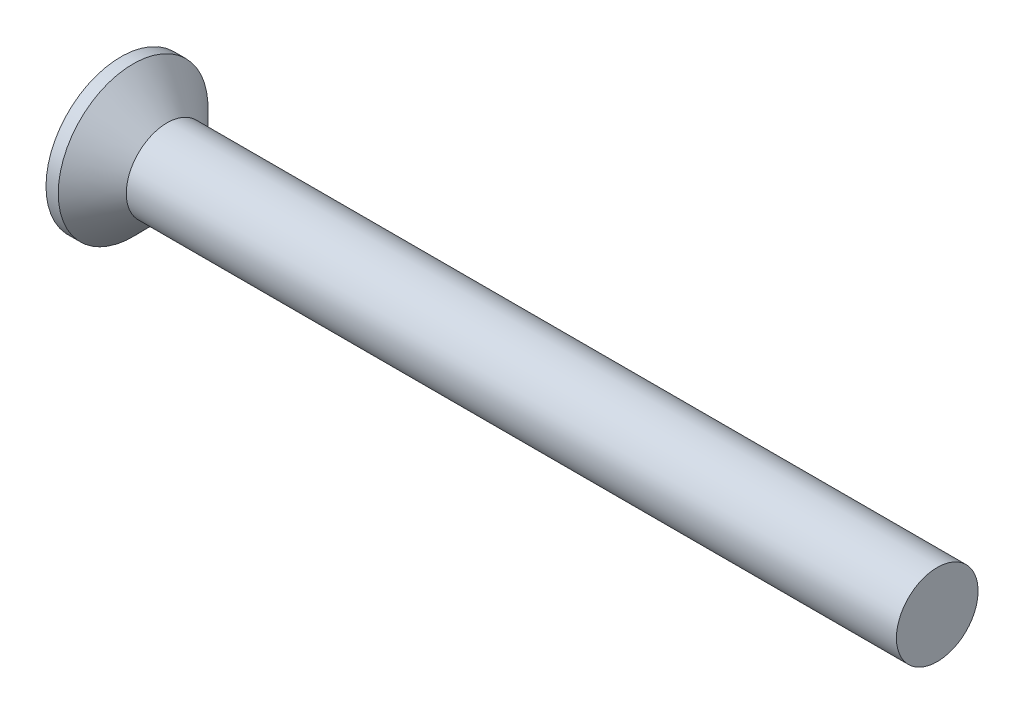
ISO-10303-21;
HEADER;
FILE_DESCRIPTION(('STEP AP214'),'2;1');
FILE_NAME('part.step','',(''),(''),'','','');
FILE_SCHEMA(('AUTOMOTIVE_DESIGN { 1 0 10303 214 1 1 1 1 }'));
ENDSEC;
DATA;
#1=APPLICATION_CONTEXT('core data for automotive mechanical design processes');
#2=APPLICATION_PROTOCOL_DEFINITION('international standard','automotive_design',2000,#1);
#3=PRODUCT_CONTEXT('',#1,'mechanical');
#4=PRODUCT('Part','Part','',(#3));
#5=PRODUCT_RELATED_PRODUCT_CATEGORY('part','',(#4));
#6=PRODUCT_DEFINITION_FORMATION('','',#4);
#7=PRODUCT_DEFINITION_CONTEXT('part definition',#1,'design');
#8=PRODUCT_DEFINITION('design','',#6,#7);
#9=PRODUCT_DEFINITION_SHAPE('','',#8);
#10=(LENGTH_UNIT() NAMED_UNIT(*) SI_UNIT(.MILLI.,.METRE.));
#11=(NAMED_UNIT(*) PLANE_ANGLE_UNIT() SI_UNIT($,.RADIAN.));
#12=(NAMED_UNIT(*) SI_UNIT($,.STERADIAN.) SOLID_ANGLE_UNIT());
#13=UNCERTAINTY_MEASURE_WITH_UNIT(LENGTH_MEASURE(1.E-05),#10,'distance_accuracy_value','');
#14=(GEOMETRIC_REPRESENTATION_CONTEXT(3) GLOBAL_UNCERTAINTY_ASSIGNED_CONTEXT((#13)) GLOBAL_UNIT_ASSIGNED_CONTEXT((#10,
#11,#12)) REPRESENTATION_CONTEXT('',''));
#15=CARTESIAN_POINT('',(0.,0.,0.));
#16=DIRECTION('',(0.,0.,1.));
#17=DIRECTION('',(1.,0.,0.));
#18=AXIS2_PLACEMENT_3D('',#15,#16,#17);
#19=CARTESIAN_POINT('',(0.,0.,0.));
#20=DIRECTION('',(-1.,0.,0.));
#21=DIRECTION('',(0.,0.,1.));
#22=AXIS2_PLACEMENT_3D('',#19,#20,#21);
#23=PLANE('',#22);
#24=CARTESIAN_POINT('',(0.,0.,0.));
#25=DIRECTION('',(-1.,0.,0.));
#26=DIRECTION('',(0.,0.,1.));
#27=AXIS2_PLACEMENT_3D('',#24,#25,#26);
#28=CIRCLE('',#27,2.75);
#29=CARTESIAN_POINT('',(0.,0.,2.75));
#30=VERTEX_POINT('',#29);
#31=EDGE_CURVE('E44',#30,#30,#28,.T.);
#32=ORIENTED_EDGE('',*,*,#31,.T.);
#33=EDGE_LOOP('',(#32));
#34=FACE_BOUND('',#33,.T.);
#35=DIRECTION('',(0.,1.,0.));
#36=VECTOR('',#35,1.);
#37=CARTESIAN_POINT('',(0.,-1.55,-0.395));
#38=LINE('',#37,#36);
#39=CARTESIAN_POINT('',(0.,-1.55,-0.395));
#40=VERTEX_POINT('',#39);
#41=CARTESIAN_POINT('',(0.,-0.394999999999998,-0.395));
#42=VERTEX_POINT('',#41);
#43=EDGE_CURVE('E105',#40,#42,#38,.T.);
#44=ORIENTED_EDGE('',*,*,#43,.T.);
#45=DIRECTION('',(0.,0.,-1.));
#46=VECTOR('',#45,1.);
#47=CARTESIAN_POINT('',(0.,-0.395000000000005,1.55));
#48=LINE('',#47,#46);
#49=CARTESIAN_POINT('',(0.,-0.394999999999995,-1.55));
#50=VERTEX_POINT('',#49);
#51=EDGE_CURVE('E85',#42,#50,#48,.T.);
#52=ORIENTED_EDGE('',*,*,#51,.T.);
#53=DIRECTION('',(0.,1.,0.));
#54=VECTOR('',#53,1.);
#55=CARTESIAN_POINT('',(0.,-0.394999999999995,-1.55));
#56=LINE('',#55,#54);
#57=CARTESIAN_POINT('',(0.,0.395000000000005,-1.55));
#58=VERTEX_POINT('',#57);
#59=EDGE_CURVE('E344',#50,#58,#56,.T.);
#60=ORIENTED_EDGE('',*,*,#59,.T.);
#61=DIRECTION('',(0.,0.,1.));
#62=VECTOR('',#61,1.);
#63=CARTESIAN_POINT('',(0.,0.395000000000005,-1.55));
#64=LINE('',#63,#62);
#65=CARTESIAN_POINT('',(0.,0.395000000000001,-0.395));
#66=VERTEX_POINT('',#65);
#67=EDGE_CURVE('E101',#58,#66,#64,.T.);
#68=ORIENTED_EDGE('',*,*,#67,.T.);
#69=CARTESIAN_POINT('',(0.,1.55,-0.395));
#70=VERTEX_POINT('',#69);
#71=EDGE_CURVE('E95',#66,#70,#38,.T.);
#72=ORIENTED_EDGE('',*,*,#71,.T.);
#73=DIRECTION('',(0.,0.,1.));
#74=VECTOR('',#73,1.);
#75=CARTESIAN_POINT('',(0.,1.55,-0.395));
#76=LINE('',#75,#74);
#77=CARTESIAN_POINT('',(0.,1.55,0.395));
#78=VERTEX_POINT('',#77);
#79=EDGE_CURVE('E98',#70,#78,#76,.T.);
#80=ORIENTED_EDGE('',*,*,#79,.T.);
#81=DIRECTION('',(0.,-1.,0.));
#82=VECTOR('',#81,1.);
#83=CARTESIAN_POINT('',(0.,1.55,0.395));
#84=LINE('',#83,#82);
#85=CARTESIAN_POINT('',(0.,0.394999999999998,0.395));
#86=VERTEX_POINT('',#85);
#87=EDGE_CURVE('E356',#78,#86,#84,.T.);
#88=ORIENTED_EDGE('',*,*,#87,.T.);
#89=CARTESIAN_POINT('',(0.,0.394999999999994,1.55));
#90=VERTEX_POINT('',#89);
#91=EDGE_CURVE('E339',#86,#90,#64,.T.);
#92=ORIENTED_EDGE('',*,*,#91,.T.);
#93=DIRECTION('',(0.,-1.,0.));
#94=VECTOR('',#93,1.);
#95=CARTESIAN_POINT('',(0.,0.394999999999994,1.55));
#96=LINE('',#95,#94);
#97=CARTESIAN_POINT('',(0.,-0.395000000000005,1.55));
#98=VERTEX_POINT('',#97);
#99=EDGE_CURVE('E325',#90,#98,#96,.T.);
#100=ORIENTED_EDGE('',*,*,#99,.T.);
#101=CARTESIAN_POINT('',(0.,-0.395000000000001,0.395));
#102=VERTEX_POINT('',#101);
#103=EDGE_CURVE('E337',#98,#102,#48,.T.);
#104=ORIENTED_EDGE('',*,*,#103,.T.);
#105=CARTESIAN_POINT('',(0.,-1.55,0.395));
#106=VERTEX_POINT('',#105);
#107=EDGE_CURVE('E111',#102,#106,#84,.T.);
#108=ORIENTED_EDGE('',*,*,#107,.T.);
#109=DIRECTION('',(0.,0.,-1.));
#110=VECTOR('',#109,1.);
#111=CARTESIAN_POINT('',(0.,-1.55,0.395));
#112=LINE('',#111,#110);
#113=EDGE_CURVE('E134',#106,#40,#112,.T.);
#114=ORIENTED_EDGE('',*,*,#113,.T.);
#115=EDGE_LOOP('',(#44,#52,#60,#68,#72,#80,#88,#92,#100,#104,#108,#114));
#116=FACE_BOUND('',#115,.T.);
#117=ADVANCED_FACE('F37',(#34,#116),#23,.T.);
#118=CARTESIAN_POINT('',(2.38373382624769,0.,0.16865988909427));
#119=DIRECTION('',(-0.0945267588569114,0.,-0.995522321125954));
#120=DIRECTION('',(-0.995522321125954,0.,0.0945267588569114));
#121=AXIS2_PLACEMENT_3D('',#118,#119,#120);
#122=PLANE('',#121);
#123=ORIENTED_EDGE('',*,*,#107,.F.);
#124=DIRECTION('',(0.991104257398676,0.0941072552097303,-0.09410725520973));
#125=VECTOR('',#124,1.);
#126=CARTESIAN_POINT('',(2.39946475118715,-0.16716620751949,0.167166207519489));
#127=LINE('',#126,#125);
#128=CARTESIAN_POINT('',(2.08,-0.197500000000001,0.197499999999999));
#129=VERTEX_POINT('',#128);
#130=EDGE_CURVE('E129',#102,#129,#127,.T.);
#131=ORIENTED_EDGE('',*,*,#130,.T.);
#132=DIRECTION('',(0.835707904588477,0.543411029305729,-0.0793520726712616));
#133=VECTOR('',#132,1.);
#134=CARTESIAN_POINT('',(0.,-1.55,0.395));
#135=LINE('',#134,#133);
#136=EDGE_CURVE('E106',#106,#129,#135,.T.);
#137=ORIENTED_EDGE('',*,*,#136,.F.);
#138=EDGE_LOOP('',(#123,#131,#137));
#139=FACE_BOUND('',#138,.T.);
#140=ADVANCED_FACE('F157',(#139),#122,.T.);
#141=DIRECTION('',(0.835707904588477,-0.543411029305729,-0.0793520726712616));
#142=VECTOR('',#141,1.);
#143=CARTESIAN_POINT('',(0.,1.55,0.395));
#144=LINE('',#143,#142);
#145=CARTESIAN_POINT('',(2.08,0.1975,0.1975));
#146=VERTEX_POINT('',#145);
#147=EDGE_CURVE('E51',#78,#146,#144,.T.);
#148=ORIENTED_EDGE('',*,*,#147,.T.);
#149=DIRECTION('',(-0.991104257398676,0.0941072552097295,0.09410725520973));
#150=VECTOR('',#149,1.);
#151=CARTESIAN_POINT('',(2.39946475118715,0.167166207519489,0.167166207519489));
#152=LINE('',#151,#150);
#153=EDGE_CURVE('E352',#146,#86,#152,.T.);
#154=ORIENTED_EDGE('',*,*,#153,.T.);
#155=ORIENTED_EDGE('',*,*,#87,.F.);
#156=EDGE_LOOP('',(#148,#154,#155));
#157=FACE_BOUND('',#156,.T.);
#158=ADVANCED_FACE('F161',(#157),#122,.T.);
#159=CARTESIAN_POINT('',(2.38373382624769,0.,-0.16865988909427));
#160=DIRECTION('',(-0.0945267588569113,0.,0.995522321125954));
#161=DIRECTION('',(0.995522321125954,0.,0.0945267588569113));
#162=AXIS2_PLACEMENT_3D('',#159,#160,#161);
#163=PLANE('',#162);
#164=DIRECTION('',(0.835707904588477,0.543411029305729,0.0793520726712615));
#165=VECTOR('',#164,1.);
#166=CARTESIAN_POINT('',(0.,-1.55,-0.395));
#167=LINE('',#166,#165);
#168=CARTESIAN_POINT('',(2.08,-0.197499999999999,-0.197500000000001));
#169=VERTEX_POINT('',#168);
#170=EDGE_CURVE('E60',#40,#169,#167,.T.);
#171=ORIENTED_EDGE('',*,*,#170,.T.);
#172=DIRECTION('',(-0.991104257398676,-0.0941072552097297,-0.0941072552097299));
#173=VECTOR('',#172,1.);
#174=CARTESIAN_POINT('',(2.39946475118715,-0.167166207519489,-0.167166207519489));
#175=LINE('',#174,#173);
#176=EDGE_CURVE('E11',#169,#42,#175,.T.);
#177=ORIENTED_EDGE('',*,*,#176,.T.);
#178=ORIENTED_EDGE('',*,*,#43,.F.);
#179=EDGE_LOOP('',(#171,#177,#178));
#180=FACE_BOUND('',#179,.T.);
#181=ADVANCED_FACE('F154',(#180),#163,.T.);
#182=ORIENTED_EDGE('',*,*,#71,.F.);
#183=DIRECTION('',(0.991104257398676,-0.0941072552097302,0.0941072552097299));
#184=VECTOR('',#183,1.);
#185=CARTESIAN_POINT('',(2.39946475118715,0.16716620751949,-0.167166207519489));
#186=LINE('',#185,#184);
#187=CARTESIAN_POINT('',(2.08,0.1975,-0.1975));
#188=VERTEX_POINT('',#187);
#189=EDGE_CURVE('E114',#66,#188,#186,.T.);
#190=ORIENTED_EDGE('',*,*,#189,.T.);
#191=DIRECTION('',(0.835707904588477,-0.543411029305729,0.0793520726712615));
#192=VECTOR('',#191,1.);
#193=CARTESIAN_POINT('',(0.,1.55,-0.395));
#194=LINE('',#193,#192);
#195=EDGE_CURVE('E110',#70,#188,#194,.T.);
#196=ORIENTED_EDGE('',*,*,#195,.F.);
#197=EDGE_LOOP('',(#182,#190,#196));
#198=FACE_BOUND('',#197,.T.);
#199=ADVANCED_FACE('F113',(#198),#163,.T.);
#200=CARTESIAN_POINT('',(-6.34999999999999,0.,0.));
#201=DIRECTION('',(-1.,0.,0.));
#202=DIRECTION('',(0.,0.,1.));
#203=AXIS2_PLACEMENT_3D('',#200,#201,#202);
#204=CYLINDRICAL_SURFACE('',#203,2.75);
#205=CARTESIAN_POINT('',(0.450000000000006,0.,0.));
#206=DIRECTION('',(-1.,0.,0.));
#207=DIRECTION('',(0.,0.,1.));
#208=AXIS2_PLACEMENT_3D('',#205,#206,#207);
#209=CIRCLE('',#208,2.75);
#210=CARTESIAN_POINT('',(0.450000000000006,0.,2.75));
#211=VERTEX_POINT('',#210);
#212=EDGE_CURVE('E137',#211,#211,#209,.T.);
#213=ORIENTED_EDGE('',*,*,#212,.T.);
#214=EDGE_LOOP('',(#213));
#215=FACE_BOUND('',#214,.T.);
#216=ORIENTED_EDGE('',*,*,#31,.F.);
#217=EDGE_LOOP('',(#216));
#218=FACE_BOUND('',#217,.T.);
#219=ADVANCED_FACE('F143',(#215,#218),#204,.T.);
#220=CARTESIAN_POINT('',(0.450000000000006,0.,0.));
#221=DIRECTION('',(-1.,0.,0.));
#222=DIRECTION('',(0.,0.,1.));
#223=AXIS2_PLACEMENT_3D('',#220,#221,#222);
#224=CONICAL_SURFACE('',#223,2.75,0.78539816339745);
#225=CARTESIAN_POINT('',(1.7,0.,0.));
#226=DIRECTION('',(-1.,0.,0.));
#227=DIRECTION('',(0.,0.,1.));
#228=AXIS2_PLACEMENT_3D('',#225,#226,#227);
#229=CIRCLE('',#228,1.5);
#230=CARTESIAN_POINT('',(1.7,0.,1.5));
#231=VERTEX_POINT('',#230);
#232=EDGE_CURVE('E133',#231,#231,#229,.T.);
#233=ORIENTED_EDGE('',*,*,#232,.T.);
#234=EDGE_LOOP('',(#233));
#235=FACE_BOUND('',#234,.T.);
#236=ORIENTED_EDGE('',*,*,#212,.F.);
#237=EDGE_LOOP('',(#236));
#238=FACE_BOUND('',#237,.T.);
#239=ADVANCED_FACE('F145',(#235,#238),#224,.T.);
#240=CARTESIAN_POINT('',(-6.34999999999999,0.,0.));
#241=DIRECTION('',(-1.,0.,0.));
#242=DIRECTION('',(0.,0.,1.));
#243=AXIS2_PLACEMENT_3D('',#240,#241,#242);
#244=CYLINDRICAL_SURFACE('',#243,1.5);
#245=CARTESIAN_POINT('',(30.,0.,0.));
#246=DIRECTION('',(-1.,0.,0.));
#247=DIRECTION('',(0.,0.,1.));
#248=AXIS2_PLACEMENT_3D('',#245,#246,#247);
#249=CIRCLE('',#248,1.5);
#250=CARTESIAN_POINT('',(30.,0.,1.5));
#251=VERTEX_POINT('',#250);
#252=EDGE_CURVE('E130',#251,#251,#249,.T.);
#253=ORIENTED_EDGE('',*,*,#252,.T.);
#254=EDGE_LOOP('',(#253));
#255=FACE_BOUND('',#254,.T.);
#256=ORIENTED_EDGE('',*,*,#232,.F.);
#257=EDGE_LOOP('',(#256));
#258=FACE_BOUND('',#257,.T.);
#259=ADVANCED_FACE('F151',(#255,#258),#244,.T.);
#260=CARTESIAN_POINT('',(30.,1.5,0.));
#261=DIRECTION('',(1.,0.,0.));
#262=DIRECTION('',(0.,0.,-1.));
#263=AXIS2_PLACEMENT_3D('',#260,#261,#262);
#264=PLANE('',#263);
#265=ORIENTED_EDGE('',*,*,#252,.F.);
#266=EDGE_LOOP('',(#265));
#267=FACE_BOUND('',#266,.T.);
#268=ADVANCED_FACE('F181',(#267),#264,.T.);
#269=CARTESIAN_POINT('',(2.08,0.1975,-0.1975));
#270=DIRECTION('',(1.,0.,0.));
#271=DIRECTION('',(0.,0.,-1.));
#272=AXIS2_PLACEMENT_3D('',#269,#270,#271);
#273=PLANE('',#272);
#274=DIRECTION('',(0.,1.,0.));
#275=VECTOR('',#274,1.);
#276=CARTESIAN_POINT('',(2.08,-0.1975,-0.1975));
#277=LINE('',#276,#275);
#278=EDGE_CURVE('E125',#169,#188,#277,.T.);
#279=ORIENTED_EDGE('',*,*,#278,.F.);
#280=DIRECTION('',(0.,0.,-1.));
#281=VECTOR('',#280,1.);
#282=CARTESIAN_POINT('',(2.08,-0.1975,0.1975));
#283=LINE('',#282,#281);
#284=EDGE_CURVE('E116',#129,#169,#283,.T.);
#285=ORIENTED_EDGE('',*,*,#284,.F.);
#286=DIRECTION('',(0.,-1.,0.));
#287=VECTOR('',#286,1.);
#288=CARTESIAN_POINT('',(2.08,0.1975,0.1975));
#289=LINE('',#288,#287);
#290=EDGE_CURVE('E119',#146,#129,#289,.T.);
#291=ORIENTED_EDGE('',*,*,#290,.F.);
#292=DIRECTION('',(0.,0.,1.));
#293=VECTOR('',#292,1.);
#294=CARTESIAN_POINT('',(2.08,0.1975,-0.1975));
#295=LINE('',#294,#293);
#296=EDGE_CURVE('E123',#188,#146,#295,.T.);
#297=ORIENTED_EDGE('',*,*,#296,.F.);
#298=EDGE_LOOP('',(#279,#285,#291,#297));
#299=FACE_BOUND('',#298,.T.);
#300=ADVANCED_FACE('F178',(#299),#273,.F.);
#301=CARTESIAN_POINT('',(2.08,-0.1975,-0.1975));
#302=DIRECTION('',(-0.54513001368185,0.838351518268576,0.));
#303=DIRECTION('',(-0.838351518268576,-0.54513001368185,0.));
#304=AXIS2_PLACEMENT_3D('',#301,#302,#303);
#305=PLANE('',#304);
#306=ORIENTED_EDGE('',*,*,#170,.F.);
#307=ORIENTED_EDGE('',*,*,#113,.F.);
#308=ORIENTED_EDGE('',*,*,#136,.T.);
#309=ORIENTED_EDGE('',*,*,#284,.T.);
#310=EDGE_LOOP('',(#306,#307,#308,#309));
#311=FACE_BOUND('',#310,.T.);
#312=ADVANCED_FACE('F170',(#311),#305,.T.);
#313=CARTESIAN_POINT('',(0.,1.55,0.395));
#314=DIRECTION('',(-0.54513001368185,-0.838351518268575,0.));
#315=DIRECTION('',(0.838351518268576,-0.54513001368185,0.));
#316=AXIS2_PLACEMENT_3D('',#313,#314,#315);
#317=PLANE('',#316);
#318=ORIENTED_EDGE('',*,*,#147,.F.);
#319=ORIENTED_EDGE('',*,*,#79,.F.);
#320=ORIENTED_EDGE('',*,*,#195,.T.);
#321=ORIENTED_EDGE('',*,*,#296,.T.);
#322=EDGE_LOOP('',(#318,#319,#320,#321));
#323=FACE_BOUND('',#322,.T.);
#324=ADVANCED_FACE('F109',(#323),#317,.T.);
#325=CARTESIAN_POINT('',(2.38373382624769,-0.16865988909427,0.));
#326=DIRECTION('',(-0.0945267588569114,0.995522321125954,0.));
#327=DIRECTION('',(-0.995522321125954,-0.0945267588569114,0.));
#328=AXIS2_PLACEMENT_3D('',#325,#326,#327);
#329=PLANE('',#328);
#330=DIRECTION('',(0.835707904588477,0.0793520726712597,0.543411029305729));
#331=VECTOR('',#330,1.);
#332=CARTESIAN_POINT('',(0.,-0.394999999999995,-1.55));
#333=LINE('',#332,#331);
#334=EDGE_CURVE('E346',#50,#169,#333,.T.);
#335=ORIENTED_EDGE('',*,*,#334,.F.);
#336=ORIENTED_EDGE('',*,*,#51,.F.);
#337=ORIENTED_EDGE('',*,*,#176,.F.);
#338=EDGE_LOOP('',(#335,#336,#337));
#339=FACE_BOUND('',#338,.T.);
#340=ADVANCED_FACE('F177',(#339),#329,.T.);
#341=CARTESIAN_POINT('',(2.38373382624769,0.16865988909427,0.));
#342=DIRECTION('',(-0.0945267588569113,-0.995522321125954,0.));
#343=DIRECTION('',(0.995522321125954,-0.0945267588569113,0.));
#344=AXIS2_PLACEMENT_3D('',#341,#342,#343);
#345=PLANE('',#344);
#346=ORIENTED_EDGE('',*,*,#67,.F.);
#347=DIRECTION('',(0.835707904588477,-0.0793520726712634,0.543411029305728));
#348=VECTOR('',#347,1.);
#349=CARTESIAN_POINT('',(0.,0.395000000000005,-1.55));
#350=LINE('',#349,#348);
#351=EDGE_CURVE('E76',#58,#188,#350,.T.);
#352=ORIENTED_EDGE('',*,*,#351,.T.);
#353=ORIENTED_EDGE('',*,*,#189,.F.);
#354=EDGE_LOOP('',(#346,#352,#353));
#355=FACE_BOUND('',#354,.T.);
#356=ADVANCED_FACE('F222',(#355),#345,.T.);
#357=CARTESIAN_POINT('',(2.08,0.1975,-0.197499999999999));
#358=DIRECTION('',(-0.54513001368185,0.,0.838351518268576));
#359=DIRECTION('',(-0.838351518268576,0.,-0.54513001368185));
#360=AXIS2_PLACEMENT_3D('',#357,#358,#359);
#361=PLANE('',#360);
#362=ORIENTED_EDGE('',*,*,#351,.F.);
#363=ORIENTED_EDGE('',*,*,#59,.F.);
#364=ORIENTED_EDGE('',*,*,#334,.T.);
#365=ORIENTED_EDGE('',*,*,#278,.T.);
#366=EDGE_LOOP('',(#362,#363,#364,#365));
#367=FACE_BOUND('',#366,.T.);
#368=ADVANCED_FACE('F230',(#367),#361,.T.);
#369=ORIENTED_EDGE('',*,*,#103,.F.);
#370=DIRECTION('',(0.835707904588477,0.0793520726712635,-0.543411029305728));
#371=VECTOR('',#370,1.);
#372=CARTESIAN_POINT('',(0.,-0.395000000000005,1.55));
#373=LINE('',#372,#371);
#374=EDGE_CURVE('E322',#98,#129,#373,.T.);
#375=ORIENTED_EDGE('',*,*,#374,.T.);
#376=ORIENTED_EDGE('',*,*,#130,.F.);
#377=EDGE_LOOP('',(#369,#375,#376));
#378=FACE_BOUND('',#377,.T.);
#379=ADVANCED_FACE('F224',(#378),#329,.T.);
#380=DIRECTION('',(0.835707904588477,-0.0793520726712596,-0.543411029305729));
#381=VECTOR('',#380,1.);
#382=CARTESIAN_POINT('',(0.,0.394999999999994,1.55));
#383=LINE('',#382,#381);
#384=EDGE_CURVE('E333',#90,#146,#383,.T.);
#385=ORIENTED_EDGE('',*,*,#384,.F.);
#386=ORIENTED_EDGE('',*,*,#91,.F.);
#387=ORIENTED_EDGE('',*,*,#153,.F.);
#388=EDGE_LOOP('',(#385,#386,#387));
#389=FACE_BOUND('',#388,.T.);
#390=ADVANCED_FACE('F232',(#389),#345,.T.);
#391=CARTESIAN_POINT('',(0.,-0.395000000000005,1.55));
#392=DIRECTION('',(-0.54513001368185,0.,-0.838351518268575));
#393=DIRECTION('',(0.838351518268576,0.,-0.54513001368185));
#394=AXIS2_PLACEMENT_3D('',#391,#392,#393);
#395=PLANE('',#394);
#396=ORIENTED_EDGE('',*,*,#374,.F.);
#397=ORIENTED_EDGE('',*,*,#99,.F.);
#398=ORIENTED_EDGE('',*,*,#384,.T.);
#399=ORIENTED_EDGE('',*,*,#290,.T.);
#400=EDGE_LOOP('',(#396,#397,#398,#399));
#401=FACE_BOUND('',#400,.T.);
#402=ADVANCED_FACE('F251',(#401),#395,.T.);
#403=CLOSED_SHELL('',(#117,#140,#158,#181,#199,#219,#239,#259,#268,#300,#312,#324,#340,#356,
#368,#379,#390,#402));
#404=MANIFOLD_SOLID_BREP('B2',#403);
#405=ADVANCED_BREP_SHAPE_REPRESENTATION('',(#18,#404),#14);
#406=SHAPE_DEFINITION_REPRESENTATION(#9,#405);
ENDSEC;
END-ISO-10303-21;
